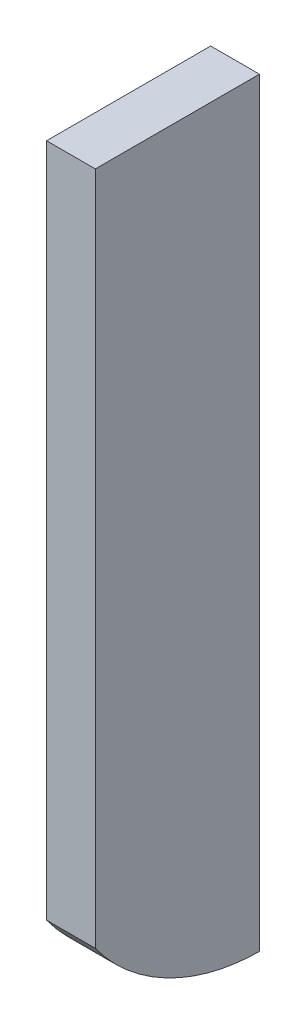
ISO-10303-21;
HEADER;
FILE_DESCRIPTION(('STEP AP214'),'2;1');
FILE_NAME('part.step','',(''),(''),'','','');
FILE_SCHEMA(('AUTOMOTIVE_DESIGN { 1 0 10303 214 1 1 1 1 }'));
ENDSEC;
DATA;
#1=APPLICATION_CONTEXT('core data for automotive mechanical design processes');
#2=APPLICATION_PROTOCOL_DEFINITION('international standard','automotive_design',2000,#1);
#3=PRODUCT_CONTEXT('',#1,'mechanical');
#4=PRODUCT('Part','Part','',(#3));
#5=PRODUCT_RELATED_PRODUCT_CATEGORY('part','',(#4));
#6=PRODUCT_DEFINITION_FORMATION('','',#4);
#7=PRODUCT_DEFINITION_CONTEXT('part definition',#1,'design');
#8=PRODUCT_DEFINITION('design','',#6,#7);
#9=PRODUCT_DEFINITION_SHAPE('','',#8);
#10=(LENGTH_UNIT() NAMED_UNIT(*) SI_UNIT(.MILLI.,.METRE.));
#11=(NAMED_UNIT(*) PLANE_ANGLE_UNIT() SI_UNIT($,.RADIAN.));
#12=(NAMED_UNIT(*) SI_UNIT($,.STERADIAN.) SOLID_ANGLE_UNIT());
#13=UNCERTAINTY_MEASURE_WITH_UNIT(LENGTH_MEASURE(1.E-05),#10,'distance_accuracy_value','');
#14=(GEOMETRIC_REPRESENTATION_CONTEXT(3) GLOBAL_UNCERTAINTY_ASSIGNED_CONTEXT((#13)) GLOBAL_UNIT_ASSIGNED_CONTEXT((#10,
#11,#12)) REPRESENTATION_CONTEXT('',''));
#15=CARTESIAN_POINT('',(0.,0.,0.));
#16=DIRECTION('',(0.,0.,1.));
#17=DIRECTION('',(1.,0.,0.));
#18=AXIS2_PLACEMENT_3D('',#15,#16,#17);
#19=CARTESIAN_POINT('',(130.275545119305,8.89509565035826,141.124945774447));
#20=CARTESIAN_POINT('',(130.275545120612,7.76007680067725,140.352622319607));
#21=CARTESIAN_POINT('',(130.275545122937,7.06234125612976,138.979096390616));
#22=CARTESIAN_POINT('',(130.27554512528,7.1152388210161,137.594668313319));
#23=B_SPLINE_CURVE_WITH_KNOTS('',3,(#19,#20,#21,#22),.UNSPECIFIED.,.F.,.F.,(4,4),(0.,
1.12963036894798),.UNSPECIFIED.);
#24=DIRECTION('',(1.,0.,1.69244514382854E-09));
#25=VECTOR('',#24,1.);
#26=SURFACE_OF_LINEAR_EXTRUSION('',#23,#25);
#27=CARTESIAN_POINT('',(131.258630216318,8.89509565035826,141.124945776111));
#28=CARTESIAN_POINT('',(131.258630217625,7.76007680067725,140.352622321271));
#29=CARTESIAN_POINT('',(131.25863021995,7.06234125612976,138.97909639228));
#30=CARTESIAN_POINT('',(131.258630222293,7.1152388210161,137.594668314983));
#31=B_SPLINE_CURVE_WITH_KNOTS('',3,(#27,#28,#29,#30),.UNSPECIFIED.,.F.,.F.,(4,4),(0.,
1.12963036894798),.UNSPECIFIED.);
#32=CARTESIAN_POINT('',(131.258630216408,8.81879535354576,141.071653747021));
#33=VERTEX_POINT('',#32);
#34=CARTESIAN_POINT('',(131.258630221997,7.1125247639851,137.769277154306));
#35=VERTEX_POINT('',#34);
#36=EDGE_CURVE('E101',#33,#35,#31,.T.);
#37=ORIENTED_EDGE('',*,*,#36,.F.);
#38=DIRECTION('',(1.,0.,1.69244514382854E-09));
#39=VECTOR('',#38,1.);
#40=CARTESIAN_POINT('',(130.275545119395,8.81879535354576,141.071653745357));
#41=LINE('',#40,#39);
#42=CARTESIAN_POINT('',(130.275545119395,8.81879535354576,141.071653745357));
#43=VERTEX_POINT('',#42);
#44=EDGE_CURVE('E33',#43,#33,#41,.T.);
#45=ORIENTED_EDGE('',*,*,#44,.F.);
#46=CARTESIAN_POINT('',(130.275545124984,7.1125247639851,137.769277152642));
#47=VERTEX_POINT('',#46);
#48=EDGE_CURVE('E120',#43,#47,#23,.T.);
#49=ORIENTED_EDGE('',*,*,#48,.T.);
#50=DIRECTION('',(1.,0.,1.69244514382854E-09));
#51=VECTOR('',#50,1.);
#52=CARTESIAN_POINT('',(130.275545124984,7.1125247639851,137.769277152642));
#53=LINE('',#52,#51);
#54=EDGE_CURVE('E10',#47,#35,#53,.T.);
#55=ORIENTED_EDGE('',*,*,#54,.T.);
#56=EDGE_LOOP('',(#37,#45,#49,#55));
#57=FACE_BOUND('',#56,.T.);
#58=ADVANCED_FACE('F16',(#57),#26,.T.);
#59=CARTESIAN_POINT('',(130.275545124731,7.2695447175601,137.919053892182));
#60=DIRECTION('',(-1.22465219939491E-09,-0.690220244787643,0.723599346106177));
#61=DIRECTION('',(0.,-0.723599346106177,-0.690220244787643));
#62=AXIS2_PLACEMENT_3D('',#59,#60,#61);
#63=PLANE('',#62);
#64=DIRECTION('',(1.1681607018954E-09,-0.723599346106177,-0.690220244787643));
#65=VECTOR('',#64,1.);
#66=CARTESIAN_POINT('',(131.258630221744,7.2695447175601,137.919053893846));
#67=LINE('',#66,#65);
#68=CARTESIAN_POINT('',(131.258630222003,7.10922215251268,137.766126889852));
#69=VERTEX_POINT('',#68);
#70=EDGE_CURVE('E106',#35,#69,#67,.T.);
#71=ORIENTED_EDGE('',*,*,#70,.F.);
#72=ORIENTED_EDGE('',*,*,#54,.F.);
#73=DIRECTION('',(1.1681607018954E-09,-0.723599346106177,-0.690220244787643));
#74=VECTOR('',#73,1.);
#75=CARTESIAN_POINT('',(130.275545124731,7.2695447175601,137.919053892182));
#76=LINE('',#75,#74);
#77=CARTESIAN_POINT('',(130.27554512499,7.10922215251268,137.766126888188));
#78=VERTEX_POINT('',#77);
#79=EDGE_CURVE('E125',#47,#78,#76,.T.);
#80=ORIENTED_EDGE('',*,*,#79,.T.);
#81=DIRECTION('',(1.,0.,1.69244514382854E-09));
#82=VECTOR('',#81,1.);
#83=CARTESIAN_POINT('',(130.27554512499,7.10922215251268,137.766126888188));
#84=LINE('',#83,#82);
#85=EDGE_CURVE('E25',#78,#69,#84,.T.);
#86=ORIENTED_EDGE('',*,*,#85,.T.);
#87=EDGE_LOOP('',(#71,#72,#80,#86));
#88=FACE_BOUND('',#87,.T.);
#89=ADVANCED_FACE('F124',(#88),#63,.T.);
#90=CARTESIAN_POINT('',(130.27554512499,7.10922215251268,137.766126888188));
#91=DIRECTION('',(1.69244514382854E-09,0.,-1.));
#92=DIRECTION('',(-1.,0.,-1.69244514382854E-09));
#93=AXIS2_PLACEMENT_3D('',#90,#91,#92);
#94=PLANE('',#93);
#95=DIRECTION('',(0.,1.,0.));
#96=VECTOR('',#95,1.);
#97=CARTESIAN_POINT('',(131.258630222003,7.10922215251268,137.766126889852));
#98=LINE('',#97,#96);
#99=CARTESIAN_POINT('',(131.258630222003,22.4180272449406,137.766126881392));
#100=VERTEX_POINT('',#99);
#101=EDGE_CURVE('E112',#69,#100,#98,.T.);
#102=ORIENTED_EDGE('',*,*,#101,.F.);
#103=ORIENTED_EDGE('',*,*,#85,.F.);
#104=DIRECTION('',(0.,1.,0.));
#105=VECTOR('',#104,1.);
#106=CARTESIAN_POINT('',(130.27554512499,7.10922215251268,137.766126888188));
#107=LINE('',#106,#105);
#108=CARTESIAN_POINT('',(130.27554512499,22.4180272449406,137.766126879728));
#109=VERTEX_POINT('',#108);
#110=EDGE_CURVE('E92',#78,#109,#107,.T.);
#111=ORIENTED_EDGE('',*,*,#110,.T.);
#112=DIRECTION('',(1.,0.,1.69244514382854E-09));
#113=VECTOR('',#112,1.);
#114=CARTESIAN_POINT('',(130.27554512499,22.4180272449406,137.766126879728));
#115=LINE('',#114,#113);
#116=EDGE_CURVE('E84',#109,#100,#115,.T.);
#117=ORIENTED_EDGE('',*,*,#116,.T.);
#118=EDGE_LOOP('',(#102,#103,#111,#117));
#119=FACE_BOUND('',#118,.T.);
#120=ADVANCED_FACE('F127',(#119),#94,.T.);
#121=CARTESIAN_POINT('',(130.27554512499,22.4180272449406,137.766126879728));
#122=DIRECTION('',(0.,1.,0.));
#123=DIRECTION('',(-1.,0.,0.));
#124=AXIS2_PLACEMENT_3D('',#121,#122,#123);
#125=PLANE('',#124);
#126=DIRECTION('',(-1.69244514382854E-09,0.,1.));
#127=VECTOR('',#126,1.);
#128=CARTESIAN_POINT('',(131.258630222003,22.4180272449406,137.766126881392));
#129=LINE('',#128,#127);
#130=CARTESIAN_POINT('',(131.258630216408,22.4180272449406,141.07198089784));
#131=VERTEX_POINT('',#130);
#132=EDGE_CURVE('E115',#100,#131,#129,.T.);
#133=ORIENTED_EDGE('',*,*,#132,.F.);
#134=ORIENTED_EDGE('',*,*,#116,.F.);
#135=DIRECTION('',(-1.69244514382854E-09,0.,1.));
#136=VECTOR('',#135,1.);
#137=CARTESIAN_POINT('',(130.27554512499,22.4180272449406,137.766126879728));
#138=LINE('',#137,#136);
#139=CARTESIAN_POINT('',(130.275545119395,22.4180272449406,141.071980896176));
#140=VERTEX_POINT('',#139);
#141=EDGE_CURVE('E87',#109,#140,#138,.T.);
#142=ORIENTED_EDGE('',*,*,#141,.T.);
#143=DIRECTION('',(1.,0.,1.69244514382854E-09));
#144=VECTOR('',#143,1.);
#145=CARTESIAN_POINT('',(130.275545119395,22.4180272449406,141.071980896176));
#146=LINE('',#145,#144);
#147=EDGE_CURVE('E73',#140,#131,#146,.T.);
#148=ORIENTED_EDGE('',*,*,#147,.T.);
#149=EDGE_LOOP('',(#133,#134,#142,#148));
#150=FACE_BOUND('',#149,.T.);
#151=ADVANCED_FACE('F88',(#150),#125,.T.);
#152=CARTESIAN_POINT('',(130.275545119395,22.4180272449406,141.071980896176));
#153=DIRECTION('',(-1.69244514382854E-09,0.,1.));
#154=DIRECTION('',(1.,0.,1.69244514382854E-09));
#155=AXIS2_PLACEMENT_3D('',#152,#153,#154);
#156=PLANE('',#155);
#157=DIRECTION('',(0.,-1.,0.));
#158=VECTOR('',#157,1.);
#159=CARTESIAN_POINT('',(131.258630216408,22.4180272449406,141.07198089784));
#160=LINE('',#159,#158);
#161=CARTESIAN_POINT('',(131.258630216408,8.81868786145453,141.07198089784));
#162=VERTEX_POINT('',#161);
#163=EDGE_CURVE('E80',#131,#162,#160,.T.);
#164=ORIENTED_EDGE('',*,*,#163,.F.);
#165=ORIENTED_EDGE('',*,*,#147,.F.);
#166=DIRECTION('',(0.,-1.,0.));
#167=VECTOR('',#166,1.);
#168=CARTESIAN_POINT('',(130.275545119395,22.4180272449406,141.071980896176));
#169=LINE('',#168,#167);
#170=CARTESIAN_POINT('',(130.275545119395,8.81868786145453,141.071980896176));
#171=VERTEX_POINT('',#170);
#172=EDGE_CURVE('E77',#140,#171,#169,.T.);
#173=ORIENTED_EDGE('',*,*,#172,.T.);
#174=DIRECTION('',(1.,0.,1.69244514382854E-09));
#175=VECTOR('',#174,1.);
#176=CARTESIAN_POINT('',(130.275545119395,8.81868786145453,141.071980896176));
#177=LINE('',#176,#175);
#178=EDGE_CURVE('E55',#171,#162,#177,.T.);
#179=ORIENTED_EDGE('',*,*,#178,.T.);
#180=EDGE_LOOP('',(#164,#165,#173,#179));
#181=FACE_BOUND('',#180,.T.);
#182=ADVANCED_FACE('F75',(#181),#156,.T.);
#183=CARTESIAN_POINT('',(130.275545119395,8.81868786145453,141.071980896176));
#184=DIRECTION('',(5.28300894888521E-10,-0.950032025332394,-0.312152448080789));
#185=DIRECTION('',(0.,0.312152448080789,-0.950032025332394));
#186=AXIS2_PLACEMENT_3D('',#183,#184,#185);
#187=PLANE('',#186);
#188=DIRECTION('',(1.60770576287001E-09,0.312152448080789,-0.950032025332394));
#189=VECTOR('',#188,1.);
#190=CARTESIAN_POINT('',(131.258630216408,8.81868786145453,141.07198089784));
#191=LINE('',#190,#189);
#192=EDGE_CURVE('E118',#162,#33,#191,.T.);
#193=ORIENTED_EDGE('',*,*,#192,.F.);
#194=ORIENTED_EDGE('',*,*,#178,.F.);
#195=DIRECTION('',(1.60770576287001E-09,0.312152448080789,-0.950032025332394));
#196=VECTOR('',#195,1.);
#197=CARTESIAN_POINT('',(130.275545119395,8.81868786145453,141.071980896176));
#198=LINE('',#197,#196);
#199=EDGE_CURVE('E96',#171,#43,#198,.T.);
#200=ORIENTED_EDGE('',*,*,#199,.T.);
#201=ORIENTED_EDGE('',*,*,#44,.T.);
#202=EDGE_LOOP('',(#193,#194,#200,#201));
#203=FACE_BOUND('',#202,.T.);
#204=ADVANCED_FACE('F151',(#203),#187,.T.);
#205=CARTESIAN_POINT('',(130.275545201028,17.2651002409467,92.8378607087388));
#206=DIRECTION('',(1.,0.,1.69244514382854E-09));
#207=DIRECTION('',(0.,1.,0.));
#208=AXIS2_PLACEMENT_3D('',#205,#206,#207);
#209=PLANE('',#208);
#210=ORIENTED_EDGE('',*,*,#48,.F.);
#211=ORIENTED_EDGE('',*,*,#199,.F.);
#212=ORIENTED_EDGE('',*,*,#172,.F.);
#213=ORIENTED_EDGE('',*,*,#141,.F.);
#214=ORIENTED_EDGE('',*,*,#110,.F.);
#215=ORIENTED_EDGE('',*,*,#79,.F.);
#216=EDGE_LOOP('',(#210,#211,#212,#213,#214,#215));
#217=FACE_BOUND('',#216,.T.);
#218=ADVANCED_FACE('F95',(#217),#209,.F.);
#219=CARTESIAN_POINT('',(131.258630298041,17.2651002409467,92.8378607104026));
#220=DIRECTION('',(1.,0.,1.69244514382854E-09));
#221=DIRECTION('',(0.,1.,0.));
#222=AXIS2_PLACEMENT_3D('',#219,#220,#221);
#223=PLANE('',#222);
#224=ORIENTED_EDGE('',*,*,#36,.T.);
#225=ORIENTED_EDGE('',*,*,#70,.T.);
#226=ORIENTED_EDGE('',*,*,#101,.T.);
#227=ORIENTED_EDGE('',*,*,#132,.T.);
#228=ORIENTED_EDGE('',*,*,#163,.T.);
#229=ORIENTED_EDGE('',*,*,#192,.T.);
#230=EDGE_LOOP('',(#224,#225,#226,#227,#228,#229));
#231=FACE_BOUND('',#230,.T.);
#232=ADVANCED_FACE('F129',(#231),#223,.T.);
#233=CLOSED_SHELL('',(#58,#89,#120,#151,#182,#204,#218,#232));
#234=MANIFOLD_SOLID_BREP('B1',#233);
#235=ADVANCED_BREP_SHAPE_REPRESENTATION('',(#18,#234),#14);
#236=SHAPE_DEFINITION_REPRESENTATION(#9,#235);
ENDSEC;
END-ISO-10303-21;
